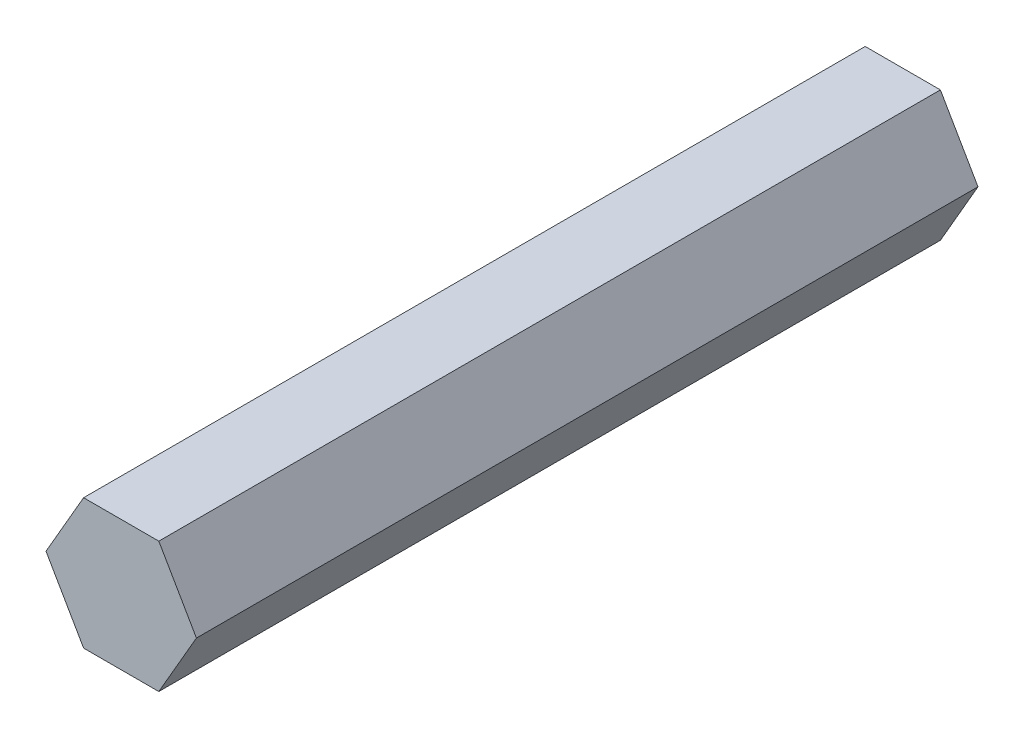
ISO-10303-21;
HEADER;
FILE_DESCRIPTION(('STEP AP214'),'2;1');
FILE_NAME('part.step','',(''),(''),'','','');
FILE_SCHEMA(('AUTOMOTIVE_DESIGN { 1 0 10303 214 1 1 1 1 }'));
ENDSEC;
DATA;
#1=APPLICATION_CONTEXT('core data for automotive mechanical design processes');
#2=APPLICATION_PROTOCOL_DEFINITION('international standard','automotive_design',2000,#1);
#3=PRODUCT_CONTEXT('',#1,'mechanical');
#4=PRODUCT('Part','Part','',(#3));
#5=PRODUCT_RELATED_PRODUCT_CATEGORY('part','',(#4));
#6=PRODUCT_DEFINITION_FORMATION('','',#4);
#7=PRODUCT_DEFINITION_CONTEXT('part definition',#1,'design');
#8=PRODUCT_DEFINITION('design','',#6,#7);
#9=PRODUCT_DEFINITION_SHAPE('','',#8);
#10=(LENGTH_UNIT() NAMED_UNIT(*) SI_UNIT(.MILLI.,.METRE.));
#11=(NAMED_UNIT(*) PLANE_ANGLE_UNIT() SI_UNIT($,.RADIAN.));
#12=(NAMED_UNIT(*) SI_UNIT($,.STERADIAN.) SOLID_ANGLE_UNIT());
#13=UNCERTAINTY_MEASURE_WITH_UNIT(LENGTH_MEASURE(1.E-05),#10,'distance_accuracy_value','');
#14=(GEOMETRIC_REPRESENTATION_CONTEXT(3) GLOBAL_UNCERTAINTY_ASSIGNED_CONTEXT((#13)) GLOBAL_UNIT_ASSIGNED_CONTEXT((#10,
#11,#12)) REPRESENTATION_CONTEXT('',''));
#15=CARTESIAN_POINT('',(0.,0.,0.));
#16=DIRECTION('',(0.,0.,1.));
#17=DIRECTION('',(1.,0.,0.));
#18=AXIS2_PLACEMENT_3D('',#15,#16,#17);
#19=CARTESIAN_POINT('',(3.66617420935419,-6.34999999999995,76.2));
#20=DIRECTION('',(-0.866025403784442,0.499999999999995,0.));
#21=DIRECTION('',(-0.499999999999995,-0.866025403784442,0.));
#22=AXIS2_PLACEMENT_3D('',#19,#20,#21);
#23=PLANE('',#22);
#24=DIRECTION('',(0.499999999999995,0.866025403784442,0.));
#25=VECTOR('',#24,1.);
#26=CARTESIAN_POINT('',(3.66617420935419,-6.34999999999995,0.));
#27=LINE('',#26,#25);
#28=CARTESIAN_POINT('',(3.66617420935419,-6.34999999999995,0.));
#29=VERTEX_POINT('',#28);
#30=CARTESIAN_POINT('',(7.33234841870824,0.,0.));
#31=VERTEX_POINT('',#30);
#32=EDGE_CURVE('E128',#29,#31,#27,.T.);
#33=ORIENTED_EDGE('',*,*,#32,.T.);
#34=DIRECTION('',(0.,0.,-1.));
#35=VECTOR('',#34,1.);
#36=CARTESIAN_POINT('',(7.33234841870824,0.,76.2));
#37=LINE('',#36,#35);
#38=CARTESIAN_POINT('',(7.33234841870824,0.,76.2));
#39=VERTEX_POINT('',#38);
#40=EDGE_CURVE('E11',#39,#31,#37,.T.);
#41=ORIENTED_EDGE('',*,*,#40,.F.);
#42=DIRECTION('',(0.499999999999995,0.866025403784442,0.));
#43=VECTOR('',#42,1.);
#44=CARTESIAN_POINT('',(3.66617420935419,-6.34999999999995,76.2));
#45=LINE('',#44,#43);
#46=CARTESIAN_POINT('',(3.66617420935419,-6.34999999999995,76.2));
#47=VERTEX_POINT('',#46);
#48=EDGE_CURVE('E144',#47,#39,#45,.T.);
#49=ORIENTED_EDGE('',*,*,#48,.F.);
#50=DIRECTION('',(0.,0.,-1.));
#51=VECTOR('',#50,1.);
#52=CARTESIAN_POINT('',(3.66617420935419,-6.34999999999995,76.2));
#53=LINE('',#52,#51);
#54=EDGE_CURVE('E124',#47,#29,#53,.T.);
#55=ORIENTED_EDGE('',*,*,#54,.T.);
#56=EDGE_LOOP('',(#33,#41,#49,#55));
#57=FACE_BOUND('',#56,.T.);
#58=ADVANCED_FACE('F39',(#57),#23,.F.);
#59=CARTESIAN_POINT('',(7.33234841870824,0.,76.2));
#60=DIRECTION('',(-0.866025403784438,-0.500000000000001,0.));
#61=DIRECTION('',(0.500000000000001,-0.866025403784438,0.));
#62=AXIS2_PLACEMENT_3D('',#59,#60,#61);
#63=PLANE('',#62);
#64=DIRECTION('',(-0.500000000000001,0.866025403784438,0.));
#65=VECTOR('',#64,1.);
#66=CARTESIAN_POINT('',(7.33234841870824,0.,0.));
#67=LINE('',#66,#65);
#68=CARTESIAN_POINT('',(3.6661742093541,6.35,0.));
#69=VERTEX_POINT('',#68);
#70=EDGE_CURVE('E132',#31,#69,#67,.T.);
#71=ORIENTED_EDGE('',*,*,#70,.T.);
#72=DIRECTION('',(0.,0.,-1.));
#73=VECTOR('',#72,1.);
#74=CARTESIAN_POINT('',(3.6661742093541,6.35,76.2));
#75=LINE('',#74,#73);
#76=CARTESIAN_POINT('',(3.6661742093541,6.35,76.2));
#77=VERTEX_POINT('',#76);
#78=EDGE_CURVE('E48',#77,#69,#75,.T.);
#79=ORIENTED_EDGE('',*,*,#78,.F.);
#80=DIRECTION('',(-0.500000000000001,0.866025403784438,0.));
#81=VECTOR('',#80,1.);
#82=CARTESIAN_POINT('',(7.33234841870824,0.,76.2));
#83=LINE('',#82,#81);
#84=EDGE_CURVE('E93',#39,#77,#83,.T.);
#85=ORIENTED_EDGE('',*,*,#84,.F.);
#86=ORIENTED_EDGE('',*,*,#40,.T.);
#87=EDGE_LOOP('',(#71,#79,#85,#86));
#88=FACE_BOUND('',#87,.T.);
#89=ADVANCED_FACE('F172',(#88),#63,.F.);
#90=CARTESIAN_POINT('',(3.6661742093541,6.35,76.2));
#91=DIRECTION('',(0.,-1.,0.));
#92=DIRECTION('',(1.,0.,0.));
#93=AXIS2_PLACEMENT_3D('',#90,#91,#92);
#94=PLANE('',#93);
#95=DIRECTION('',(-1.,0.,0.));
#96=VECTOR('',#95,1.);
#97=CARTESIAN_POINT('',(3.6661742093541,6.35,0.));
#98=LINE('',#97,#96);
#99=CARTESIAN_POINT('',(-3.66617420935415,6.34999999999997,0.));
#100=VERTEX_POINT('',#99);
#101=EDGE_CURVE('E135',#69,#100,#98,.T.);
#102=ORIENTED_EDGE('',*,*,#101,.T.);
#103=DIRECTION('',(0.,0.,-1.));
#104=VECTOR('',#103,1.);
#105=CARTESIAN_POINT('',(-3.66617420935415,6.34999999999997,76.2));
#106=LINE('',#105,#104);
#107=CARTESIAN_POINT('',(-3.66617420935415,6.34999999999997,76.2));
#108=VERTEX_POINT('',#107);
#109=EDGE_CURVE('E117',#108,#100,#106,.T.);
#110=ORIENTED_EDGE('',*,*,#109,.F.);
#111=DIRECTION('',(-1.,0.,0.));
#112=VECTOR('',#111,1.);
#113=CARTESIAN_POINT('',(3.6661742093541,6.35,76.2));
#114=LINE('',#113,#112);
#115=EDGE_CURVE('E106',#77,#108,#114,.T.);
#116=ORIENTED_EDGE('',*,*,#115,.F.);
#117=ORIENTED_EDGE('',*,*,#78,.T.);
#118=EDGE_LOOP('',(#102,#110,#116,#117));
#119=FACE_BOUND('',#118,.T.);
#120=ADVANCED_FACE('F154',(#119),#94,.F.);
#121=CARTESIAN_POINT('',(-3.66617420935415,6.34999999999997,76.2));
#122=DIRECTION('',(0.866025403784442,-0.499999999999995,0.));
#123=DIRECTION('',(0.499999999999995,0.866025403784442,0.));
#124=AXIS2_PLACEMENT_3D('',#121,#122,#123);
#125=PLANE('',#124);
#126=DIRECTION('',(-0.499999999999995,-0.866025403784442,0.));
#127=VECTOR('',#126,1.);
#128=CARTESIAN_POINT('',(-3.66617420935415,6.34999999999997,0.));
#129=LINE('',#128,#127);
#130=CARTESIAN_POINT('',(-7.33234841870824,0.,0.));
#131=VERTEX_POINT('',#130);
#132=EDGE_CURVE('E115',#100,#131,#129,.T.);
#133=ORIENTED_EDGE('',*,*,#132,.T.);
#134=DIRECTION('',(0.,0.,-1.));
#135=VECTOR('',#134,1.);
#136=CARTESIAN_POINT('',(-7.33234841870824,0.,76.2));
#137=LINE('',#136,#135);
#138=CARTESIAN_POINT('',(-7.33234841870824,0.,76.2));
#139=VERTEX_POINT('',#138);
#140=EDGE_CURVE('E112',#139,#131,#137,.T.);
#141=ORIENTED_EDGE('',*,*,#140,.F.);
#142=DIRECTION('',(-0.499999999999995,-0.866025403784442,0.));
#143=VECTOR('',#142,1.);
#144=CARTESIAN_POINT('',(-3.66617420935415,6.34999999999997,76.2));
#145=LINE('',#144,#143);
#146=EDGE_CURVE('E100',#108,#139,#145,.T.);
#147=ORIENTED_EDGE('',*,*,#146,.F.);
#148=ORIENTED_EDGE('',*,*,#109,.T.);
#149=EDGE_LOOP('',(#133,#141,#147,#148));
#150=FACE_BOUND('',#149,.T.);
#151=ADVANCED_FACE('F113',(#150),#125,.F.);
#152=CARTESIAN_POINT('',(-7.33234841870824,0.,76.2));
#153=DIRECTION('',(0.866025403784434,0.500000000000007,0.));
#154=DIRECTION('',(-0.500000000000007,0.866025403784435,0.));
#155=AXIS2_PLACEMENT_3D('',#152,#153,#154);
#156=PLANE('',#155);
#157=DIRECTION('',(0.500000000000007,-0.866025403784435,0.));
#158=VECTOR('',#157,1.);
#159=CARTESIAN_POINT('',(-7.33234841870824,0.,0.));
#160=LINE('',#159,#158);
#161=CARTESIAN_POINT('',(-3.66617420935406,-6.35000000000002,0.));
#162=VERTEX_POINT('',#161);
#163=EDGE_CURVE('E79',#131,#162,#160,.T.);
#164=ORIENTED_EDGE('',*,*,#163,.T.);
#165=DIRECTION('',(0.,0.,-1.));
#166=VECTOR('',#165,1.);
#167=CARTESIAN_POINT('',(-3.66617420935406,-6.35000000000002,76.2));
#168=LINE('',#167,#166);
#169=CARTESIAN_POINT('',(-3.66617420935406,-6.35000000000002,76.2));
#170=VERTEX_POINT('',#169);
#171=EDGE_CURVE('E118',#170,#162,#168,.T.);
#172=ORIENTED_EDGE('',*,*,#171,.F.);
#173=DIRECTION('',(0.500000000000007,-0.866025403784435,0.));
#174=VECTOR('',#173,1.);
#175=CARTESIAN_POINT('',(-7.33234841870824,0.,76.2));
#176=LINE('',#175,#174);
#177=EDGE_CURVE('E104',#139,#170,#176,.T.);
#178=ORIENTED_EDGE('',*,*,#177,.F.);
#179=ORIENTED_EDGE('',*,*,#140,.T.);
#180=EDGE_LOOP('',(#164,#172,#178,#179));
#181=FACE_BOUND('',#180,.T.);
#182=ADVANCED_FACE('F120',(#181),#156,.F.);
#183=CARTESIAN_POINT('',(-3.66617420935406,-6.35000000000002,76.2));
#184=DIRECTION('',(0.,1.,0.));
#185=DIRECTION('',(-1.,0.,0.));
#186=AXIS2_PLACEMENT_3D('',#183,#184,#185);
#187=PLANE('',#186);
#188=DIRECTION('',(1.,0.,0.));
#189=VECTOR('',#188,1.);
#190=CARTESIAN_POINT('',(-3.66617420935406,-6.35000000000002,0.));
#191=LINE('',#190,#189);
#192=EDGE_CURVE('E85',#162,#29,#191,.T.);
#193=ORIENTED_EDGE('',*,*,#192,.T.);
#194=ORIENTED_EDGE('',*,*,#54,.F.);
#195=DIRECTION('',(1.,0.,0.));
#196=VECTOR('',#195,1.);
#197=CARTESIAN_POINT('',(-3.66617420935406,-6.35000000000002,76.2));
#198=LINE('',#197,#196);
#199=EDGE_CURVE('E56',#170,#47,#198,.T.);
#200=ORIENTED_EDGE('',*,*,#199,.F.);
#201=ORIENTED_EDGE('',*,*,#171,.T.);
#202=EDGE_LOOP('',(#193,#194,#200,#201));
#203=FACE_BOUND('',#202,.T.);
#204=ADVANCED_FACE('F161',(#203),#187,.F.);
#205=CARTESIAN_POINT('',(0.,0.,76.2));
#206=DIRECTION('',(0.,0.,1.));
#207=DIRECTION('',(1.,0.,0.));
#208=AXIS2_PLACEMENT_3D('',#205,#206,#207);
#209=PLANE('',#208);
#210=ORIENTED_EDGE('',*,*,#48,.T.);
#211=ORIENTED_EDGE('',*,*,#84,.T.);
#212=ORIENTED_EDGE('',*,*,#115,.T.);
#213=ORIENTED_EDGE('',*,*,#146,.T.);
#214=ORIENTED_EDGE('',*,*,#177,.T.);
#215=ORIENTED_EDGE('',*,*,#199,.T.);
#216=EDGE_LOOP('',(#210,#211,#212,#213,#214,#215));
#217=FACE_BOUND('',#216,.T.);
#218=ADVANCED_FACE('F102',(#217),#209,.T.);
#219=CARTESIAN_POINT('',(0.,0.,0.));
#220=DIRECTION('',(0.,0.,1.));
#221=DIRECTION('',(1.,0.,0.));
#222=AXIS2_PLACEMENT_3D('',#219,#220,#221);
#223=PLANE('',#222);
#224=ORIENTED_EDGE('',*,*,#32,.F.);
#225=ORIENTED_EDGE('',*,*,#192,.F.);
#226=ORIENTED_EDGE('',*,*,#163,.F.);
#227=ORIENTED_EDGE('',*,*,#132,.F.);
#228=ORIENTED_EDGE('',*,*,#101,.F.);
#229=ORIENTED_EDGE('',*,*,#70,.F.);
#230=EDGE_LOOP('',(#224,#225,#226,#227,#228,#229));
#231=FACE_BOUND('',#230,.T.);
#232=ADVANCED_FACE('F157',(#231),#223,.F.);
#233=CLOSED_SHELL('',(#58,#89,#120,#151,#182,#204,#218,#232));
#234=MANIFOLD_SOLID_BREP('B2',#233);
#235=ADVANCED_BREP_SHAPE_REPRESENTATION('',(#18,#234),#14);
#236=SHAPE_DEFINITION_REPRESENTATION(#9,#235);
ENDSEC;
END-ISO-10303-21;
